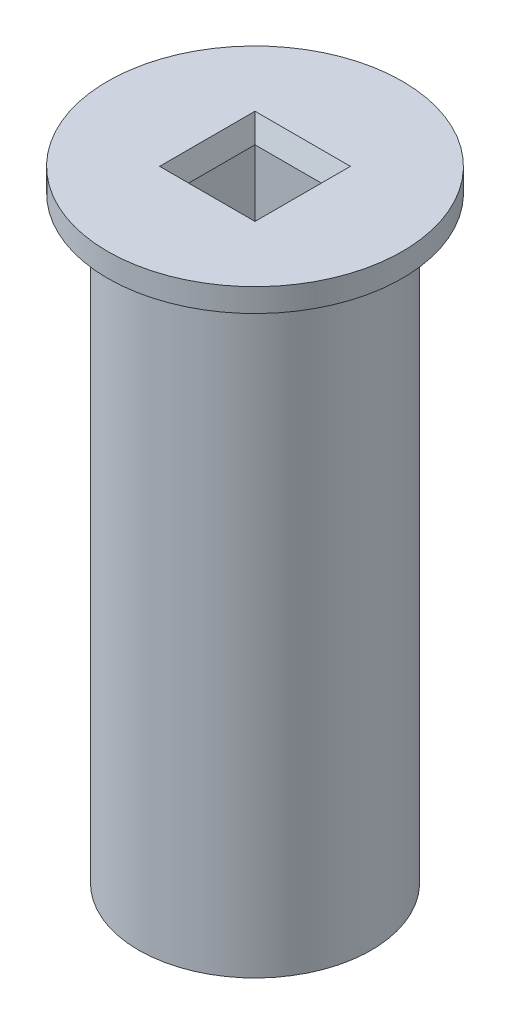
ISO-10303-21;
HEADER;
FILE_DESCRIPTION(('STEP AP214'),'2;1');
FILE_NAME('part.step','',(''),(''),'','','');
FILE_SCHEMA(('AUTOMOTIVE_DESIGN { 1 0 10303 214 1 1 1 1 }'));
ENDSEC;
DATA;
#1=APPLICATION_CONTEXT('core data for automotive mechanical design processes');
#2=APPLICATION_PROTOCOL_DEFINITION('international standard','automotive_design',2000,#1);
#3=PRODUCT_CONTEXT('',#1,'mechanical');
#4=PRODUCT('Part','Part','',(#3));
#5=PRODUCT_RELATED_PRODUCT_CATEGORY('part','',(#4));
#6=PRODUCT_DEFINITION_FORMATION('','',#4);
#7=PRODUCT_DEFINITION_CONTEXT('part definition',#1,'design');
#8=PRODUCT_DEFINITION('design','',#6,#7);
#9=PRODUCT_DEFINITION_SHAPE('','',#8);
#10=(LENGTH_UNIT() NAMED_UNIT(*) SI_UNIT(.MILLI.,.METRE.));
#11=(NAMED_UNIT(*) PLANE_ANGLE_UNIT() SI_UNIT($,.RADIAN.));
#12=(NAMED_UNIT(*) SI_UNIT($,.STERADIAN.) SOLID_ANGLE_UNIT());
#13=UNCERTAINTY_MEASURE_WITH_UNIT(LENGTH_MEASURE(1.E-05),#10,'distance_accuracy_value','');
#14=(GEOMETRIC_REPRESENTATION_CONTEXT(3) GLOBAL_UNCERTAINTY_ASSIGNED_CONTEXT((#13)) GLOBAL_UNIT_ASSIGNED_CONTEXT((#10,
#11,#12)) REPRESENTATION_CONTEXT('',''));
#15=CARTESIAN_POINT('',(0.,0.,0.));
#16=DIRECTION('',(0.,0.,1.));
#17=DIRECTION('',(1.,0.,0.));
#18=AXIS2_PLACEMENT_3D('',#15,#16,#17);
#19=CARTESIAN_POINT('',(0.,80.,0.));
#20=DIRECTION('',(0.,-1.,0.));
#21=DIRECTION('',(0.,0.,-1.));
#22=AXIS2_PLACEMENT_3D('',#19,#20,#21);
#23=CYLINDRICAL_SURFACE('',#22,15.);
#24=CARTESIAN_POINT('',(0.,0.,0.));
#25=DIRECTION('',(0.,1.,0.));
#26=DIRECTION('',(0.,0.,1.));
#27=AXIS2_PLACEMENT_3D('',#24,#25,#26);
#28=CIRCLE('',#27,15.);
#29=CARTESIAN_POINT('',(0.,0.,15.));
#30=VERTEX_POINT('',#29);
#31=EDGE_CURVE('E94',#30,#30,#28,.T.);
#32=ORIENTED_EDGE('',*,*,#31,.T.);
#33=EDGE_LOOP('',(#32));
#34=FACE_BOUND('',#33,.T.);
#35=CARTESIAN_POINT('',(0.,77.,0.));
#36=DIRECTION('',(0.,1.,0.));
#37=DIRECTION('',(0.,0.,1.));
#38=AXIS2_PLACEMENT_3D('',#35,#36,#37);
#39=CIRCLE('',#38,15.);
#40=CARTESIAN_POINT('',(0.,77.,15.));
#41=VERTEX_POINT('',#40);
#42=EDGE_CURVE('E115',#41,#41,#39,.T.);
#43=ORIENTED_EDGE('',*,*,#42,.F.);
#44=EDGE_LOOP('',(#43));
#45=FACE_BOUND('',#44,.T.);
#46=ADVANCED_FACE('F35',(#34,#45),#23,.T.);
#47=CARTESIAN_POINT('',(0.,80.,0.));
#48=DIRECTION('',(0.,1.,0.));
#49=DIRECTION('',(0.,0.,1.));
#50=AXIS2_PLACEMENT_3D('',#47,#48,#49);
#51=PLANE('',#50);
#52=DIRECTION('',(1.,0.,0.));
#53=VECTOR('',#52,1.);
#54=CARTESIAN_POINT('',(0.,80.,-6.15));
#55=LINE('',#54,#53);
#56=CARTESIAN_POINT('',(-6.15,80.,-6.15));
#57=VERTEX_POINT('',#56);
#58=CARTESIAN_POINT('',(6.15,80.,-6.15));
#59=VERTEX_POINT('',#58);
#60=EDGE_CURVE('E130',#57,#59,#55,.T.);
#61=ORIENTED_EDGE('',*,*,#60,.T.);
#62=DIRECTION('',(0.,0.,1.));
#63=VECTOR('',#62,1.);
#64=CARTESIAN_POINT('',(6.15,80.,0.));
#65=LINE('',#64,#63);
#66=CARTESIAN_POINT('',(6.15,80.,6.15));
#67=VERTEX_POINT('',#66);
#68=EDGE_CURVE('E136',#59,#67,#65,.T.);
#69=ORIENTED_EDGE('',*,*,#68,.T.);
#70=DIRECTION('',(-1.,0.,0.));
#71=VECTOR('',#70,1.);
#72=CARTESIAN_POINT('',(0.,80.,6.15));
#73=LINE('',#72,#71);
#74=CARTESIAN_POINT('',(-6.15,80.,6.15));
#75=VERTEX_POINT('',#74);
#76=EDGE_CURVE('E134',#67,#75,#73,.T.);
#77=ORIENTED_EDGE('',*,*,#76,.T.);
#78=DIRECTION('',(0.,0.,-1.));
#79=VECTOR('',#78,1.);
#80=CARTESIAN_POINT('',(-6.15,80.,0.));
#81=LINE('',#80,#79);
#82=EDGE_CURVE('E132',#75,#57,#81,.T.);
#83=ORIENTED_EDGE('',*,*,#82,.T.);
#84=EDGE_LOOP('',(#61,#69,#77,#83));
#85=FACE_BOUND('',#84,.T.);
#86=CARTESIAN_POINT('',(0.,80.,0.));
#87=DIRECTION('',(0.,1.,0.));
#88=DIRECTION('',(0.,0.,1.));
#89=AXIS2_PLACEMENT_3D('',#86,#87,#88);
#90=CIRCLE('',#89,19.);
#91=CARTESIAN_POINT('',(0.,80.,19.));
#92=VERTEX_POINT('',#91);
#93=EDGE_CURVE('E112',#92,#92,#90,.T.);
#94=ORIENTED_EDGE('',*,*,#93,.T.);
#95=EDGE_LOOP('',(#94));
#96=FACE_BOUND('',#95,.T.);
#97=ADVANCED_FACE('F157',(#85,#96),#51,.T.);
#98=CARTESIAN_POINT('',(0.,0.,0.));
#99=DIRECTION('',(0.,1.,0.));
#100=DIRECTION('',(0.,0.,1.));
#101=AXIS2_PLACEMENT_3D('',#98,#99,#100);
#102=PLANE('',#101);
#103=ORIENTED_EDGE('',*,*,#31,.F.);
#104=EDGE_LOOP('',(#103));
#105=FACE_BOUND('',#104,.T.);
#106=DIRECTION('',(0.,0.,1.));
#107=VECTOR('',#106,1.);
#108=CARTESIAN_POINT('',(-5.15,0.,5.15));
#109=LINE('',#108,#107);
#110=CARTESIAN_POINT('',(-5.15,0.,-5.15));
#111=VERTEX_POINT('',#110);
#112=CARTESIAN_POINT('',(-5.15,0.,5.15));
#113=VERTEX_POINT('',#112);
#114=EDGE_CURVE('E90',#111,#113,#109,.T.);
#115=ORIENTED_EDGE('',*,*,#114,.T.);
#116=DIRECTION('',(1.,0.,0.));
#117=VECTOR('',#116,1.);
#118=CARTESIAN_POINT('',(5.15,0.,5.15));
#119=LINE('',#118,#117);
#120=CARTESIAN_POINT('',(5.15,0.,5.15));
#121=VERTEX_POINT('',#120);
#122=EDGE_CURVE('E98',#113,#121,#119,.T.);
#123=ORIENTED_EDGE('',*,*,#122,.T.);
#124=DIRECTION('',(0.,0.,-1.));
#125=VECTOR('',#124,1.);
#126=CARTESIAN_POINT('',(5.15,0.,5.15));
#127=LINE('',#126,#125);
#128=CARTESIAN_POINT('',(5.15,0.,-5.15));
#129=VERTEX_POINT('',#128);
#130=EDGE_CURVE('E104',#121,#129,#127,.T.);
#131=ORIENTED_EDGE('',*,*,#130,.T.);
#132=DIRECTION('',(-1.,0.,0.));
#133=VECTOR('',#132,1.);
#134=CARTESIAN_POINT('',(5.15,0.,-5.15));
#135=LINE('',#134,#133);
#136=EDGE_CURVE('E108',#129,#111,#135,.T.);
#137=ORIENTED_EDGE('',*,*,#136,.T.);
#138=EDGE_LOOP('',(#115,#123,#131,#137));
#139=FACE_BOUND('',#138,.T.);
#140=ADVANCED_FACE('F106',(#105,#139),#102,.F.);
#141=CARTESIAN_POINT('',(-5.15,80.,5.15));
#142=DIRECTION('',(1.,0.,0.));
#143=DIRECTION('',(0.,0.,-1.));
#144=AXIS2_PLACEMENT_3D('',#141,#142,#143);
#145=PLANE('',#144);
#146=DIRECTION('',(0.,-1.,0.));
#147=VECTOR('',#146,1.);
#148=CARTESIAN_POINT('',(-5.15,80.,-5.15));
#149=LINE('',#148,#147);
#150=CARTESIAN_POINT('',(-5.15,77.2525225805453,-5.15));
#151=VERTEX_POINT('',#150);
#152=EDGE_CURVE('E120',#151,#111,#149,.T.);
#153=ORIENTED_EDGE('',*,*,#152,.F.);
#154=DIRECTION('',(0.,0.,1.));
#155=VECTOR('',#154,1.);
#156=CARTESIAN_POINT('',(-5.15,77.2525225805453,5.15));
#157=LINE('',#156,#155);
#158=CARTESIAN_POINT('',(-5.15,77.2525225805453,5.15));
#159=VERTEX_POINT('',#158);
#160=EDGE_CURVE('E44',#151,#159,#157,.T.);
#161=ORIENTED_EDGE('',*,*,#160,.T.);
#162=DIRECTION('',(0.,-1.,0.));
#163=VECTOR('',#162,1.);
#164=CARTESIAN_POINT('',(-5.15,80.,5.15));
#165=LINE('',#164,#163);
#166=EDGE_CURVE('E86',#159,#113,#165,.T.);
#167=ORIENTED_EDGE('',*,*,#166,.T.);
#168=ORIENTED_EDGE('',*,*,#114,.F.);
#169=EDGE_LOOP('',(#153,#161,#167,#168));
#170=FACE_BOUND('',#169,.T.);
#171=ADVANCED_FACE('F88',(#170),#145,.T.);
#172=CARTESIAN_POINT('',(5.15,80.,5.15));
#173=DIRECTION('',(0.,0.,-1.));
#174=DIRECTION('',(-1.,0.,0.));
#175=AXIS2_PLACEMENT_3D('',#172,#173,#174);
#176=PLANE('',#175);
#177=ORIENTED_EDGE('',*,*,#166,.F.);
#178=DIRECTION('',(1.,0.,0.));
#179=VECTOR('',#178,1.);
#180=CARTESIAN_POINT('',(5.15,77.2525225805453,5.15));
#181=LINE('',#180,#179);
#182=CARTESIAN_POINT('',(5.15,77.2525225805453,5.15));
#183=VERTEX_POINT('',#182);
#184=EDGE_CURVE('E139',#159,#183,#181,.T.);
#185=ORIENTED_EDGE('',*,*,#184,.T.);
#186=DIRECTION('',(0.,-1.,0.));
#187=VECTOR('',#186,1.);
#188=CARTESIAN_POINT('',(5.15,80.,5.15));
#189=LINE('',#188,#187);
#190=EDGE_CURVE('E95',#183,#121,#189,.T.);
#191=ORIENTED_EDGE('',*,*,#190,.T.);
#192=ORIENTED_EDGE('',*,*,#122,.F.);
#193=EDGE_LOOP('',(#177,#185,#191,#192));
#194=FACE_BOUND('',#193,.T.);
#195=ADVANCED_FACE('F99',(#194),#176,.T.);
#196=CARTESIAN_POINT('',(5.15,80.,5.15));
#197=DIRECTION('',(-1.,0.,0.));
#198=DIRECTION('',(0.,0.,1.));
#199=AXIS2_PLACEMENT_3D('',#196,#197,#198);
#200=PLANE('',#199);
#201=ORIENTED_EDGE('',*,*,#190,.F.);
#202=DIRECTION('',(0.,0.,-1.));
#203=VECTOR('',#202,1.);
#204=CARTESIAN_POINT('',(5.15,77.2525225805453,5.15));
#205=LINE('',#204,#203);
#206=CARTESIAN_POINT('',(5.15,77.2525225805453,-5.15));
#207=VERTEX_POINT('',#206);
#208=EDGE_CURVE('E127',#183,#207,#205,.T.);
#209=ORIENTED_EDGE('',*,*,#208,.T.);
#210=DIRECTION('',(0.,-1.,0.));
#211=VECTOR('',#210,1.);
#212=CARTESIAN_POINT('',(5.15,80.,-5.15));
#213=LINE('',#212,#211);
#214=EDGE_CURVE('E122',#207,#129,#213,.T.);
#215=ORIENTED_EDGE('',*,*,#214,.T.);
#216=ORIENTED_EDGE('',*,*,#130,.F.);
#217=EDGE_LOOP('',(#201,#209,#215,#216));
#218=FACE_BOUND('',#217,.T.);
#219=ADVANCED_FACE('F246',(#218),#200,.T.);
#220=CARTESIAN_POINT('',(5.15,80.,-5.15));
#221=DIRECTION('',(0.,0.,1.));
#222=DIRECTION('',(1.,0.,0.));
#223=AXIS2_PLACEMENT_3D('',#220,#221,#222);
#224=PLANE('',#223);
#225=ORIENTED_EDGE('',*,*,#214,.F.);
#226=DIRECTION('',(-1.,0.,0.));
#227=VECTOR('',#226,1.);
#228=CARTESIAN_POINT('',(5.15,77.2525225805453,-5.15));
#229=LINE('',#228,#227);
#230=EDGE_CURVE('E11',#207,#151,#229,.T.);
#231=ORIENTED_EDGE('',*,*,#230,.T.);
#232=ORIENTED_EDGE('',*,*,#152,.T.);
#233=ORIENTED_EDGE('',*,*,#136,.F.);
#234=EDGE_LOOP('',(#225,#231,#232,#233));
#235=FACE_BOUND('',#234,.T.);
#236=ADVANCED_FACE('F170',(#235),#224,.T.);
#237=CARTESIAN_POINT('',(0.,77.,0.));
#238=DIRECTION('',(0.,1.,0.));
#239=DIRECTION('',(0.,0.,1.));
#240=AXIS2_PLACEMENT_3D('',#237,#238,#239);
#241=PLANE('',#240);
#242=CARTESIAN_POINT('',(0.,77.,0.));
#243=DIRECTION('',(0.,1.,0.));
#244=DIRECTION('',(0.,0.,1.));
#245=AXIS2_PLACEMENT_3D('',#242,#243,#244);
#246=CIRCLE('',#245,19.);
#247=CARTESIAN_POINT('',(0.,77.,19.));
#248=VERTEX_POINT('',#247);
#249=EDGE_CURVE('E109',#248,#248,#246,.T.);
#250=ORIENTED_EDGE('',*,*,#249,.F.);
#251=EDGE_LOOP('',(#250));
#252=FACE_BOUND('',#251,.T.);
#253=ORIENTED_EDGE('',*,*,#42,.T.);
#254=EDGE_LOOP('',(#253));
#255=FACE_BOUND('',#254,.T.);
#256=ADVANCED_FACE('F161',(#252,#255),#241,.F.);
#257=CARTESIAN_POINT('',(0.,77.,0.));
#258=DIRECTION('',(0.,1.,0.));
#259=DIRECTION('',(0.,0.,1.));
#260=AXIS2_PLACEMENT_3D('',#257,#258,#259);
#261=CYLINDRICAL_SURFACE('',#260,19.);
#262=ORIENTED_EDGE('',*,*,#249,.T.);
#263=EDGE_LOOP('',(#262));
#264=FACE_BOUND('',#263,.T.);
#265=ORIENTED_EDGE('',*,*,#93,.F.);
#266=EDGE_LOOP('',(#265));
#267=FACE_BOUND('',#266,.T.);
#268=ADVANCED_FACE('F159',(#264,#267),#261,.T.);
#269=CARTESIAN_POINT('',(-5.15,77.2525225805453,5.15));
#270=DIRECTION('',(-0.939692620785909,-0.342020143325666,0.));
#271=DIRECTION('',(0.,0.,1.));
#272=AXIS2_PLACEMENT_3D('',#269,#270,#271);
#273=PLANE('',#272);
#274=DIRECTION('',(0.323615577118182,-0.88912649071599,0.323615577118182));
#275=VECTOR('',#274,1.);
#276=CARTESIAN_POINT('',(-4.0713114699386,74.2888502015769,-4.0713114699386));
#277=LINE('',#276,#275);
#278=EDGE_CURVE('E145',#57,#151,#277,.T.);
#279=ORIENTED_EDGE('',*,*,#278,.F.);
#280=ORIENTED_EDGE('',*,*,#82,.F.);
#281=DIRECTION('',(0.323615577118182,-0.88912649071599,-0.323615577118182));
#282=VECTOR('',#281,1.);
#283=CARTESIAN_POINT('',(-4.0713114699386,74.2888502015769,4.0713114699386));
#284=LINE('',#283,#282);
#285=EDGE_CURVE('E39',#159,#75,#284,.F.);
#286=ORIENTED_EDGE('',*,*,#285,.F.);
#287=ORIENTED_EDGE('',*,*,#160,.F.);
#288=EDGE_LOOP('',(#279,#280,#286,#287));
#289=FACE_BOUND('',#288,.T.);
#290=ADVANCED_FACE('F37',(#289),#273,.F.);
#291=CARTESIAN_POINT('',(5.15,77.2525225805453,5.15));
#292=DIRECTION('',(0.,-0.342020143325666,0.939692620785909));
#293=DIRECTION('',(1.,0.,0.));
#294=AXIS2_PLACEMENT_3D('',#291,#292,#293);
#295=PLANE('',#294);
#296=ORIENTED_EDGE('',*,*,#285,.T.);
#297=ORIENTED_EDGE('',*,*,#76,.F.);
#298=DIRECTION('',(-0.323615577118182,-0.88912649071599,-0.323615577118182));
#299=VECTOR('',#298,1.);
#300=CARTESIAN_POINT('',(5.15,77.2525225805453,5.15));
#301=LINE('',#300,#299);
#302=EDGE_CURVE('E144',#183,#67,#301,.F.);
#303=ORIENTED_EDGE('',*,*,#302,.F.);
#304=ORIENTED_EDGE('',*,*,#184,.F.);
#305=EDGE_LOOP('',(#296,#297,#303,#304));
#306=FACE_BOUND('',#305,.T.);
#307=ADVANCED_FACE('F168',(#306),#295,.F.);
#308=CARTESIAN_POINT('',(5.15,77.2525225805453,-5.15));
#309=DIRECTION('',(0.,-0.342020143325666,-0.939692620785909));
#310=DIRECTION('',(-1.,0.,0.));
#311=AXIS2_PLACEMENT_3D('',#308,#309,#310);
#312=PLANE('',#311);
#313=ORIENTED_EDGE('',*,*,#278,.T.);
#314=ORIENTED_EDGE('',*,*,#230,.F.);
#315=DIRECTION('',(0.323615577118182,0.88912649071599,-0.323615577118182));
#316=VECTOR('',#315,1.);
#317=CARTESIAN_POINT('',(4.0713114699386,74.2888502015769,-4.0713114699386));
#318=LINE('',#317,#316);
#319=EDGE_CURVE('E142',#59,#207,#318,.F.);
#320=ORIENTED_EDGE('',*,*,#319,.F.);
#321=ORIENTED_EDGE('',*,*,#60,.F.);
#322=EDGE_LOOP('',(#313,#314,#320,#321));
#323=FACE_BOUND('',#322,.T.);
#324=ADVANCED_FACE('F188',(#323),#312,.F.);
#325=CARTESIAN_POINT('',(5.15,77.2525225805453,5.15));
#326=DIRECTION('',(0.939692620785909,-0.342020143325666,0.));
#327=DIRECTION('',(0.,0.,-1.));
#328=AXIS2_PLACEMENT_3D('',#325,#326,#327);
#329=PLANE('',#328);
#330=ORIENTED_EDGE('',*,*,#302,.T.);
#331=ORIENTED_EDGE('',*,*,#68,.F.);
#332=ORIENTED_EDGE('',*,*,#319,.T.);
#333=ORIENTED_EDGE('',*,*,#208,.F.);
#334=EDGE_LOOP('',(#330,#331,#332,#333));
#335=FACE_BOUND('',#334,.T.);
#336=ADVANCED_FACE('F185',(#335),#329,.F.);
#337=CLOSED_SHELL('',(#46,#97,#140,#171,#195,#219,#236,#256,#268,#290,#307,#324,#336));
#338=MANIFOLD_SOLID_BREP('B2',#337);
#339=ADVANCED_BREP_SHAPE_REPRESENTATION('',(#18,#338),#14);
#340=SHAPE_DEFINITION_REPRESENTATION(#9,#339);
ENDSEC;
END-ISO-10303-21;
